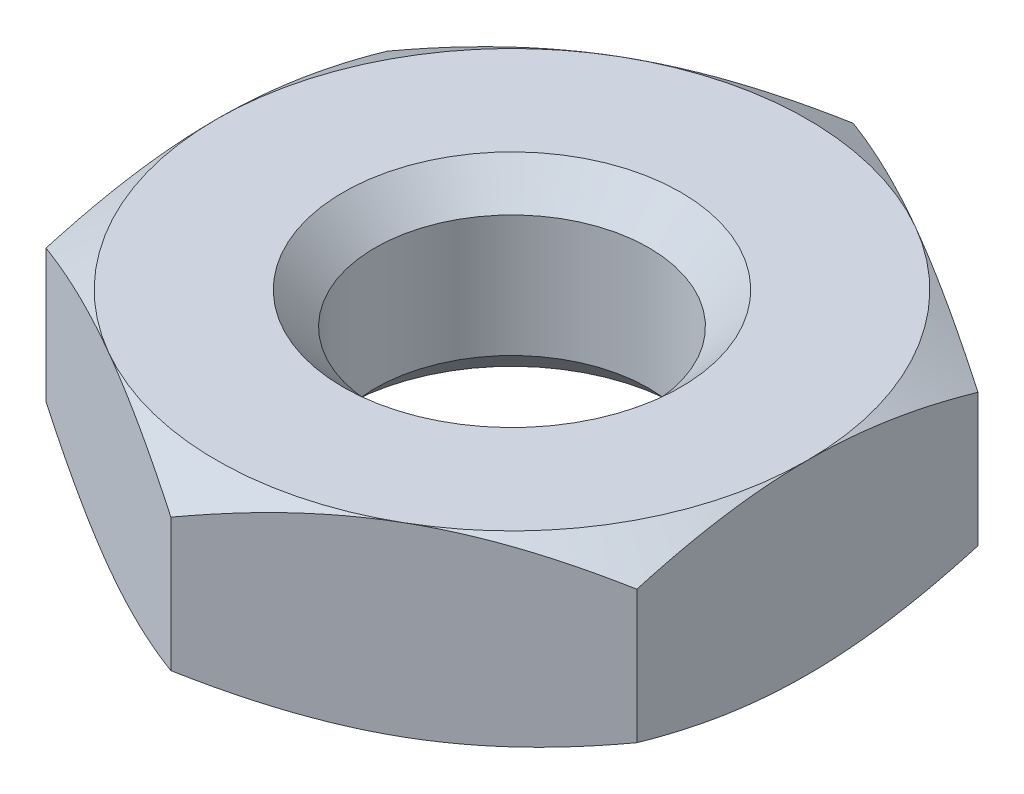
ISO-10303-21;
HEADER;
FILE_DESCRIPTION(('STEP AP214'),'2;1');
FILE_NAME('part.step','',(''),(''),'','','');
FILE_SCHEMA(('AUTOMOTIVE_DESIGN { 1 0 10303 214 1 1 1 1 }'));
ENDSEC;
DATA;
#1=APPLICATION_CONTEXT('core data for automotive mechanical design processes');
#2=APPLICATION_PROTOCOL_DEFINITION('international standard','automotive_design',2000,#1);
#3=PRODUCT_CONTEXT('',#1,'mechanical');
#4=PRODUCT('Part','Part','',(#3));
#5=PRODUCT_RELATED_PRODUCT_CATEGORY('part','',(#4));
#6=PRODUCT_DEFINITION_FORMATION('','',#4);
#7=PRODUCT_DEFINITION_CONTEXT('part definition',#1,'design');
#8=PRODUCT_DEFINITION('design','',#6,#7);
#9=PRODUCT_DEFINITION_SHAPE('','',#8);
#10=(LENGTH_UNIT() NAMED_UNIT(*) SI_UNIT(.MILLI.,.METRE.));
#11=(NAMED_UNIT(*) PLANE_ANGLE_UNIT() SI_UNIT($,.RADIAN.));
#12=(NAMED_UNIT(*) SI_UNIT($,.STERADIAN.) SOLID_ANGLE_UNIT());
#13=UNCERTAINTY_MEASURE_WITH_UNIT(LENGTH_MEASURE(1.E-05),#10,'distance_accuracy_value','');
#14=(GEOMETRIC_REPRESENTATION_CONTEXT(3) GLOBAL_UNCERTAINTY_ASSIGNED_CONTEXT((#13)) GLOBAL_UNIT_ASSIGNED_CONTEXT((#10,
#11,#12)) REPRESENTATION_CONTEXT('',''));
#15=CARTESIAN_POINT('',(0.,0.,0.));
#16=DIRECTION('',(0.,0.,1.));
#17=DIRECTION('',(1.,0.,0.));
#18=AXIS2_PLACEMENT_3D('',#15,#16,#17);
#19=CARTESIAN_POINT('',(0.,2.2,-4.04145188432738));
#20=DIRECTION('',(0.5,0.,0.866025403784439));
#21=DIRECTION('',(0.,-1.,0.));
#22=AXIS2_PLACEMENT_3D('',#19,#20,#21);
#23=PLANE('',#22);
#24=DIRECTION('',(0.,-1.,0.));
#25=VECTOR('',#24,1.);
#26=CARTESIAN_POINT('',(0.,2.2,-4.04145188432738));
#27=LINE('',#26,#25);
#28=CARTESIAN_POINT('',(0.,1.88739260883036,-4.04145188432738));
#29=VERTEX_POINT('',#28);
#30=CARTESIAN_POINT('',(0.,0.312607391169647,-4.04145188432738));
#31=VERTEX_POINT('',#30);
#32=EDGE_CURVE('E602',#29,#31,#27,.T.);
#33=ORIENTED_EDGE('',*,*,#32,.T.);
#34=CARTESIAN_POINT('',(1.22834702560197E-13,0.312607391168655,-4.04145188432745));
#35=CARTESIAN_POINT('',(-0.937822173505779,0.,-3.50000000000182));
#36=CARTESIAN_POINT('',(-1.75,0.,-3.03108891324553));
#37=B_SPLINE_CURVE_WITH_KNOTS('',2,(#34,#35,#36),.UNSPECIFIED.,.F.,.F.,(3,3),(0.,1.),.UNSPECIFIED.);
#38=CARTESIAN_POINT('',(-1.75,0.,-3.03108891324554));
#39=VERTEX_POINT('',#38);
#40=EDGE_CURVE('E11',#31,#39,#37,.T.);
#41=ORIENTED_EDGE('',*,*,#40,.T.);
#42=CARTESIAN_POINT('',(-1.75,0.,-3.03108891324553));
#43=CARTESIAN_POINT('',(-2.18326695106445,0.,-2.78094212241751));
#44=CARTESIAN_POINT('',(-2.6350882433519,0.0843875357508751,-2.52008297768974));
#45=CARTESIAN_POINT('',(-3.04504654739941,0.16095624030225,-2.28339344049139));
#46=CARTESIAN_POINT('',(-3.50000000000007,0.312607391169145,-2.02072594216365));
#47=B_SPLINE_CURVE_WITH_KNOTS('',2,(#42,#43,#44,#45,#46),.UNSPECIFIED.,.F.,.F.,(3,2,3),(0.,0.5,
1.),.UNSPECIFIED.);
#48=CARTESIAN_POINT('',(-3.5,0.312607391169648,-2.02072594216369));
#49=VERTEX_POINT('',#48);
#50=EDGE_CURVE('E29',#39,#49,#47,.T.);
#51=ORIENTED_EDGE('',*,*,#50,.T.);
#52=DIRECTION('',(0.,-1.,0.));
#53=VECTOR('',#52,1.);
#54=CARTESIAN_POINT('',(-3.5,2.2,-2.02072594216369));
#55=LINE('',#54,#53);
#56=CARTESIAN_POINT('',(-3.5,1.88739260883036,-2.02072594216369));
#57=VERTEX_POINT('',#56);
#58=EDGE_CURVE('E420',#57,#49,#55,.T.);
#59=ORIENTED_EDGE('',*,*,#58,.F.);
#60=CARTESIAN_POINT('',(-3.50000000000012,1.88739260883135,-2.02072594216362));
#61=CARTESIAN_POINT('',(-2.56217782649422,2.2,-2.56217782648925));
#62=CARTESIAN_POINT('',(-1.75,2.2,-3.03108891324553));
#63=B_SPLINE_CURVE_WITH_KNOTS('',2,(#60,#61,#62),.UNSPECIFIED.,.F.,.F.,(3,3),(0.,1.),.UNSPECIFIED.);
#64=CARTESIAN_POINT('',(-1.75,2.2,-3.03108891324554));
#65=VERTEX_POINT('',#64);
#66=EDGE_CURVE('E467',#57,#65,#63,.T.);
#67=ORIENTED_EDGE('',*,*,#66,.T.);
#68=CARTESIAN_POINT('',(-1.75,2.2,-3.03108891324553));
#69=CARTESIAN_POINT('',(-1.31673304893373,2.2,-3.28123570407461));
#70=CARTESIAN_POINT('',(-0.864911756648105,2.11561246424913,-3.54209484880132));
#71=CARTESIAN_POINT('',(-0.454953452598556,2.03904375969707,-3.77878438600085));
#72=CARTESIAN_POINT('',(0.,1.88739260883086,-4.04145188432742));
#73=B_SPLINE_CURVE_WITH_KNOTS('',2,(#68,#69,#70,#71,#72),.UNSPECIFIED.,.F.,.F.,(3,2,3),(0.,0.5,
1.),.UNSPECIFIED.);
#74=EDGE_CURVE('E124',#65,#29,#73,.T.);
#75=ORIENTED_EDGE('',*,*,#74,.T.);
#76=EDGE_LOOP('',(#33,#41,#51,#59,#67,#75));
#77=FACE_BOUND('',#76,.T.);
#78=ADVANCED_FACE('F16',(#77),#23,.F.);
#79=CARTESIAN_POINT('',(0.,0.788648588267139,0.));
#80=DIRECTION('',(0.,1.,0.));
#81=DIRECTION('',(0.,0.,1.));
#82=AXIS2_PLACEMENT_3D('',#79,#80,#81);
#83=CONICAL_SURFACE('',#82,4.8659794242,1.0471975512);
#84=CARTESIAN_POINT('',(0.,0.,0.));
#85=DIRECTION('',(0.,-1.,0.));
#86=DIRECTION('',(0.,0.,1.));
#87=AXIS2_PLACEMENT_3D('',#84,#85,#86);
#88=CIRCLE('',#87,3.5);
#89=CARTESIAN_POINT('',(1.75,0.,-3.03108891324554));
#90=VERTEX_POINT('',#89);
#91=CARTESIAN_POINT('',(3.5,0.,0.));
#92=VERTEX_POINT('',#91);
#93=EDGE_CURVE('E168',#90,#92,#88,.T.);
#94=ORIENTED_EDGE('',*,*,#93,.F.);
#95=CARTESIAN_POINT('',(3.50000000000012,0.312607391168655,-2.02072594216362));
#96=CARTESIAN_POINT('',(2.56217782649423,0.,-2.56217782648925));
#97=CARTESIAN_POINT('',(1.75,0.,-3.03108891324554));
#98=B_SPLINE_CURVE_WITH_KNOTS('',2,(#95,#96,#97),.UNSPECIFIED.,.F.,.F.,(3,3),(0.,1.),.UNSPECIFIED.);
#99=CARTESIAN_POINT('',(3.5,0.312607391169648,-2.02072594216369));
#100=VERTEX_POINT('',#99);
#101=EDGE_CURVE('E639',#100,#90,#98,.T.);
#102=ORIENTED_EDGE('',*,*,#101,.F.);
#103=CARTESIAN_POINT('',(3.5,0.,0.));
#104=CARTESIAN_POINT('',(3.5,0.,-0.498474251196286));
#105=CARTESIAN_POINT('',(3.5,0.0837611927453101,-1.01813471750671));
#106=CARTESIAN_POINT('',(3.5,0.160347693152985,-1.49328287634384));
#107=CARTESIAN_POINT('',(3.5,0.31260739116964,-2.02072594216369));
#108=B_SPLINE_CURVE_WITH_KNOTS('',2,(#103,#104,#105,#106,#107),.UNSPECIFIED.,.F.,.F.,(3,2,3),
(0.,0.5,1.),.UNSPECIFIED.);
#109=EDGE_CURVE('E968',#92,#100,#108,.T.);
#110=ORIENTED_EDGE('',*,*,#109,.F.);
#111=EDGE_LOOP('',(#94,#102,#110));
#112=FACE_BOUND('',#111,.T.);
#113=ADVANCED_FACE('F617',(#112),#83,.T.);
#114=CARTESIAN_POINT('',(0.,0.788648588267139,0.));
#115=DIRECTION('',(0.,1.,0.));
#116=DIRECTION('',(0.,0.,1.));
#117=AXIS2_PLACEMENT_3D('',#114,#115,#116);
#118=CONICAL_SURFACE('',#117,4.8659794242,1.0471975512);
#119=CARTESIAN_POINT('',(1.75,0.,-3.03108891324554));
#120=CARTESIAN_POINT('',(1.31673304893498,0.,-3.28123570407389));
#121=CARTESIAN_POINT('',(0.864911756648104,0.0843875357508751,-3.54209484880132));
#122=CARTESIAN_POINT('',(0.454953452599909,0.160956240302475,-3.77878438600007));
#123=CARTESIAN_POINT('',(0.,0.312607391169145,-4.04145188432742));
#124=B_SPLINE_CURVE_WITH_KNOTS('',2,(#119,#120,#121,#122,#123),.UNSPECIFIED.,.F.,.F.,(3,2,3),
(0.,0.5,1.),.UNSPECIFIED.);
#125=EDGE_CURVE('E606',#90,#31,#124,.T.);
#126=ORIENTED_EDGE('',*,*,#125,.F.);
#127=CARTESIAN_POINT('',(0.,0.,0.));
#128=DIRECTION('',(0.,-1.,0.));
#129=DIRECTION('',(0.,0.,1.));
#130=AXIS2_PLACEMENT_3D('',#127,#128,#129);
#131=CIRCLE('',#130,3.5);
#132=EDGE_CURVE('E594',#39,#90,#131,.T.);
#133=ORIENTED_EDGE('',*,*,#132,.F.);
#134=ORIENTED_EDGE('',*,*,#40,.F.);
#135=EDGE_LOOP('',(#126,#133,#134));
#136=FACE_BOUND('',#135,.T.);
#137=ADVANCED_FACE('F410',(#136),#118,.T.);
#138=CARTESIAN_POINT('',(0.,0.788648588267139,0.));
#139=DIRECTION('',(0.,1.,0.));
#140=DIRECTION('',(0.,0.,1.));
#141=AXIS2_PLACEMENT_3D('',#138,#139,#140);
#142=CONICAL_SURFACE('',#141,4.8659794242,1.0471975512);
#143=ORIENTED_EDGE('',*,*,#50,.F.);
#144=CARTESIAN_POINT('',(0.,0.,0.));
#145=DIRECTION('',(0.,-1.,0.));
#146=DIRECTION('',(0.,0.,1.));
#147=AXIS2_PLACEMENT_3D('',#144,#145,#146);
#148=CIRCLE('',#147,3.5);
#149=CARTESIAN_POINT('',(-3.5,0.,0.));
#150=VERTEX_POINT('',#149);
#151=EDGE_CURVE('E590',#150,#39,#148,.T.);
#152=ORIENTED_EDGE('',*,*,#151,.F.);
#153=CARTESIAN_POINT('',(-3.5,0.31260739116964,-2.02072594216369));
#154=CARTESIAN_POINT('',(-3.5,0.160519053630475,-1.49387648645068));
#155=CARTESIAN_POINT('',(-3.5,0.0837611927453101,-1.01813471750671));
#156=CARTESIAN_POINT('',(-3.5,0.,-0.49898661272657));
#157=CARTESIAN_POINT('',(-3.5,0.,0.));
#158=B_SPLINE_CURVE_WITH_KNOTS('',2,(#153,#154,#155,#156,#157),.UNSPECIFIED.,.F.,.F.,(3,2,3),
(0.,0.5,1.),.UNSPECIFIED.);
#159=EDGE_CURVE('E385',#49,#150,#158,.T.);
#160=ORIENTED_EDGE('',*,*,#159,.F.);
#161=EDGE_LOOP('',(#143,#152,#160));
#162=FACE_BOUND('',#161,.T.);
#163=ADVANCED_FACE('F402',(#162),#142,.T.);
#164=CARTESIAN_POINT('',(0.,0.788648588267139,0.));
#165=DIRECTION('',(0.,1.,0.));
#166=DIRECTION('',(0.,0.,1.));
#167=AXIS2_PLACEMENT_3D('',#164,#165,#166);
#168=CONICAL_SURFACE('',#167,4.8659794242,1.0471975512);
#169=CARTESIAN_POINT('',(0.,0.,0.));
#170=DIRECTION('',(0.,-1.,0.));
#171=DIRECTION('',(0.,0.,1.));
#172=AXIS2_PLACEMENT_3D('',#169,#170,#171);
#173=CIRCLE('',#172,3.5);
#174=CARTESIAN_POINT('',(-1.75,0.,3.03108891324554));
#175=VERTEX_POINT('',#174);
#176=EDGE_CURVE('E595',#175,#150,#173,.T.);
#177=ORIENTED_EDGE('',*,*,#176,.F.);
#178=CARTESIAN_POINT('',(-3.50000000000012,0.312607391168655,2.02072594216362));
#179=CARTESIAN_POINT('',(-2.56217782649423,0.,2.56217782648925));
#180=CARTESIAN_POINT('',(-1.75,0.,3.03108891324554));
#181=B_SPLINE_CURVE_WITH_KNOTS('',2,(#178,#179,#180),.UNSPECIFIED.,.F.,.F.,(3,3),(0.,1.),.UNSPECIFIED.);
#182=CARTESIAN_POINT('',(-3.5,0.312607391169648,2.02072594216369));
#183=VERTEX_POINT('',#182);
#184=EDGE_CURVE('E569',#183,#175,#181,.T.);
#185=ORIENTED_EDGE('',*,*,#184,.F.);
#186=CARTESIAN_POINT('',(-3.5,0.,0.));
#187=CARTESIAN_POINT('',(-3.5,0.,0.50199947639047));
#188=CARTESIAN_POINT('',(-3.5,0.0849764910881953,1.0256452662635));
#189=CARTESIAN_POINT('',(-3.5,0.161527003296065,1.49736812651518));
#190=CARTESIAN_POINT('',(-3.5,0.31260739116965,2.02072594216369));
#191=B_SPLINE_CURVE_WITH_KNOTS('',2,(#186,#187,#188,#189,#190),.UNSPECIFIED.,.F.,.F.,(3,2,3),
(0.,0.5,1.),.UNSPECIFIED.);
#192=EDGE_CURVE('E373',#150,#183,#191,.T.);
#193=ORIENTED_EDGE('',*,*,#192,.F.);
#194=EDGE_LOOP('',(#177,#185,#193));
#195=FACE_BOUND('',#194,.T.);
#196=ADVANCED_FACE('F214',(#195),#168,.T.);
#197=CARTESIAN_POINT('',(0.,0.788648588267139,0.));
#198=DIRECTION('',(0.,1.,0.));
#199=DIRECTION('',(0.,0.,1.));
#200=AXIS2_PLACEMENT_3D('',#197,#198,#199);
#201=CONICAL_SURFACE('',#200,4.8659794242,1.0471975512);
#202=CARTESIAN_POINT('',(0.,0.,0.));
#203=DIRECTION('',(0.,-1.,0.));
#204=DIRECTION('',(0.,0.,1.));
#205=AXIS2_PLACEMENT_3D('',#202,#203,#204);
#206=CIRCLE('',#205,3.5);
#207=CARTESIAN_POINT('',(1.75,0.,3.03108891324554));
#208=VERTEX_POINT('',#207);
#209=EDGE_CURVE('E162',#92,#208,#206,.T.);
#210=ORIENTED_EDGE('',*,*,#209,.F.);
#211=CARTESIAN_POINT('',(3.5,0.31260739116965,2.02072594216369));
#212=CARTESIAN_POINT('',(3.5,0.161698384794715,1.49796180944146));
#213=CARTESIAN_POINT('',(3.5,0.0849764910881953,1.0256452662635));
#214=CARTESIAN_POINT('',(3.5,0.,0.502511639300405));
#215=CARTESIAN_POINT('',(3.5,0.,0.));
#216=B_SPLINE_CURVE_WITH_KNOTS('',2,(#211,#212,#213,#214,#215),.UNSPECIFIED.,.F.,.F.,(3,2,3),
(0.,0.5,1.),.UNSPECIFIED.);
#217=CARTESIAN_POINT('',(3.5,0.312607391169648,2.02072594216369));
#218=VERTEX_POINT('',#217);
#219=EDGE_CURVE('E178',#218,#92,#216,.T.);
#220=ORIENTED_EDGE('',*,*,#219,.F.);
#221=CARTESIAN_POINT('',(1.75,0.,3.03108891324553));
#222=CARTESIAN_POINT('',(2.18326695106445,0.,2.78094212241751));
#223=CARTESIAN_POINT('',(2.6350882433519,0.0843875357508742,2.52008297768974));
#224=CARTESIAN_POINT('',(3.04504654739941,0.160956240302249,2.28339344049139));
#225=CARTESIAN_POINT('',(3.50000000000007,0.312607391169139,2.02072594216365));
#226=B_SPLINE_CURVE_WITH_KNOTS('',2,(#221,#222,#223,#224,#225),.UNSPECIFIED.,.F.,.F.,(3,2,3),
(0.,0.5,1.),.UNSPECIFIED.);
#227=EDGE_CURVE('E174',#208,#218,#226,.T.);
#228=ORIENTED_EDGE('',*,*,#227,.F.);
#229=EDGE_LOOP('',(#210,#220,#228));
#230=FACE_BOUND('',#229,.T.);
#231=ADVANCED_FACE('F176',(#230),#201,.T.);
#232=CARTESIAN_POINT('',(0.,2.2,0.));
#233=DIRECTION('',(0.,-1.,0.));
#234=DIRECTION('',(0.,0.,-1.));
#235=AXIS2_PLACEMENT_3D('',#232,#233,#234);
#236=CONICAL_SURFACE('',#235,3.5,1.0471975512);
#237=CARTESIAN_POINT('',(-1.26201132877313E-13,1.88739260883135,-4.04145188432745));
#238=CARTESIAN_POINT('',(0.937822173505772,2.2,-3.50000000000182));
#239=CARTESIAN_POINT('',(1.75,2.2,-3.03108891324554));
#240=B_SPLINE_CURVE_WITH_KNOTS('',2,(#237,#238,#239),.UNSPECIFIED.,.F.,.F.,(3,3),(0.,1.),.UNSPECIFIED.);
#241=CARTESIAN_POINT('',(1.75,2.2,-3.03108891324554));
#242=VERTEX_POINT('',#241);
#243=EDGE_CURVE('E605',#29,#242,#240,.T.);
#244=ORIENTED_EDGE('',*,*,#243,.F.);
#245=ORIENTED_EDGE('',*,*,#74,.F.);
#246=CARTESIAN_POINT('',(0.,2.2,0.));
#247=DIRECTION('',(0.,-1.,0.));
#248=DIRECTION('',(0.,0.,1.));
#249=AXIS2_PLACEMENT_3D('',#246,#247,#248);
#250=CIRCLE('',#249,3.5);
#251=EDGE_CURVE('E444',#65,#242,#250,.T.);
#252=ORIENTED_EDGE('',*,*,#251,.T.);
#253=EDGE_LOOP('',(#244,#245,#252));
#254=FACE_BOUND('',#253,.T.);
#255=ADVANCED_FACE('F249',(#254),#236,.T.);
#256=CARTESIAN_POINT('',(0.,2.2,0.));
#257=DIRECTION('',(0.,-1.,0.));
#258=DIRECTION('',(0.,0.,-1.));
#259=AXIS2_PLACEMENT_3D('',#256,#257,#258);
#260=CONICAL_SURFACE('',#259,3.5,1.0471975512);
#261=CARTESIAN_POINT('',(0.,2.2,0.));
#262=DIRECTION('',(0.,-1.,0.));
#263=DIRECTION('',(0.,0.,1.));
#264=AXIS2_PLACEMENT_3D('',#261,#262,#263);
#265=CIRCLE('',#264,3.5);
#266=CARTESIAN_POINT('',(1.75,2.2,3.03108891324554));
#267=VERTEX_POINT('',#266);
#268=CARTESIAN_POINT('',(-1.75,2.2,3.03108891324554));
#269=VERTEX_POINT('',#268);
#270=EDGE_CURVE('E510',#267,#269,#265,.T.);
#271=ORIENTED_EDGE('',*,*,#270,.T.);
#272=CARTESIAN_POINT('',(1.26201132877313E-13,1.88739260883135,4.04145188432745));
#273=CARTESIAN_POINT('',(-0.937822173505772,2.2,3.50000000000182));
#274=CARTESIAN_POINT('',(-1.75,2.2,3.03108891324554));
#275=B_SPLINE_CURVE_WITH_KNOTS('',2,(#272,#273,#274),.UNSPECIFIED.,.F.,.F.,(3,3),(0.,1.),.UNSPECIFIED.);
#276=CARTESIAN_POINT('',(0.,1.88739260883036,4.04145188432738));
#277=VERTEX_POINT('',#276);
#278=EDGE_CURVE('E552',#277,#269,#275,.T.);
#279=ORIENTED_EDGE('',*,*,#278,.F.);
#280=CARTESIAN_POINT('',(1.75,2.2,3.03108891324553));
#281=CARTESIAN_POINT('',(1.31673304893373,2.2,3.28123570407461));
#282=CARTESIAN_POINT('',(0.864911756648105,2.11561246424913,3.54209484880132));
#283=CARTESIAN_POINT('',(0.454953452598556,2.03904375969707,3.77878438600085));
#284=CARTESIAN_POINT('',(0.,1.88739260883086,4.04145188432742));
#285=B_SPLINE_CURVE_WITH_KNOTS('',2,(#280,#281,#282,#283,#284),.UNSPECIFIED.,.F.,.F.,(3,2,3),
(0.,0.5,1.),.UNSPECIFIED.);
#286=EDGE_CURVE('E969',#267,#277,#285,.T.);
#287=ORIENTED_EDGE('',*,*,#286,.F.);
#288=EDGE_LOOP('',(#271,#279,#287));
#289=FACE_BOUND('',#288,.T.);
#290=ADVANCED_FACE('F238',(#289),#260,.T.);
#291=CARTESIAN_POINT('',(0.,2.2,0.));
#292=DIRECTION('',(0.,-1.,0.));
#293=DIRECTION('',(0.,0.,-1.));
#294=AXIS2_PLACEMENT_3D('',#291,#292,#293);
#295=CONICAL_SURFACE('',#294,3.5,1.0471975512);
#296=CARTESIAN_POINT('',(1.75,2.2,-3.03108891324554));
#297=CARTESIAN_POINT('',(2.18326695106652,2.2,-2.78094212241631));
#298=CARTESIAN_POINT('',(2.6350882433519,2.11561246424912,-2.52008297768974));
#299=CARTESIAN_POINT('',(3.04504654740179,2.03904375969695,-2.28339344049002));
#300=CARTESIAN_POINT('',(3.50000000000007,1.88739260883086,-2.02072594216365));
#301=B_SPLINE_CURVE_WITH_KNOTS('',2,(#296,#297,#298,#299,#300),.UNSPECIFIED.,.F.,.F.,(3,2,3),
(0.,0.5,1.),.UNSPECIFIED.);
#302=CARTESIAN_POINT('',(3.5,1.88739260883036,-2.02072594216369));
#303=VERTEX_POINT('',#302);
#304=EDGE_CURVE('E428',#242,#303,#301,.T.);
#305=ORIENTED_EDGE('',*,*,#304,.F.);
#306=CARTESIAN_POINT('',(0.,2.2,0.));
#307=DIRECTION('',(0.,-1.,0.));
#308=DIRECTION('',(0.,0.,1.));
#309=AXIS2_PLACEMENT_3D('',#306,#307,#308);
#310=CIRCLE('',#309,3.5);
#311=CARTESIAN_POINT('',(3.5,2.2,0.));
#312=VERTEX_POINT('',#311);
#313=EDGE_CURVE('E453',#242,#312,#310,.T.);
#314=ORIENTED_EDGE('',*,*,#313,.T.);
#315=CARTESIAN_POINT('',(3.5,1.88739260883037,-2.02072594216369));
#316=CARTESIAN_POINT('',(3.5,2.0394809463691,-1.49387648645213));
#317=CARTESIAN_POINT('',(3.5,2.11623880725469,-1.0181347175067));
#318=CARTESIAN_POINT('',(3.5,2.2,-0.49898661272787));
#319=CARTESIAN_POINT('',(3.5,2.2,0.));
#320=B_SPLINE_CURVE_WITH_KNOTS('',2,(#315,#316,#317,#318,#319),.UNSPECIFIED.,.F.,.F.,(3,2,3),
(0.,0.5,1.),.UNSPECIFIED.);
#321=EDGE_CURVE('E962',#303,#312,#320,.T.);
#322=ORIENTED_EDGE('',*,*,#321,.F.);
#323=EDGE_LOOP('',(#305,#314,#322));
#324=FACE_BOUND('',#323,.T.);
#325=ADVANCED_FACE('F248',(#324),#295,.T.);
#326=CARTESIAN_POINT('',(0.,2.2,0.));
#327=DIRECTION('',(0.,-1.,0.));
#328=DIRECTION('',(0.,0.,-1.));
#329=AXIS2_PLACEMENT_3D('',#326,#327,#328);
#330=CONICAL_SURFACE('',#329,3.5,1.0471975512);
#331=CARTESIAN_POINT('',(0.,2.2,0.));
#332=DIRECTION('',(0.,-1.,0.));
#333=DIRECTION('',(0.,0.,1.));
#334=AXIS2_PLACEMENT_3D('',#331,#332,#333);
#335=CIRCLE('',#334,3.5);
#336=CARTESIAN_POINT('',(-3.5,2.2,0.));
#337=VERTEX_POINT('',#336);
#338=EDGE_CURVE('E456',#337,#65,#335,.T.);
#339=ORIENTED_EDGE('',*,*,#338,.T.);
#340=ORIENTED_EDGE('',*,*,#66,.F.);
#341=CARTESIAN_POINT('',(-3.5,2.2,0.));
#342=CARTESIAN_POINT('',(-3.5,2.2,-0.49847425119368));
#343=CARTESIAN_POINT('',(-3.5,2.11623880725469,-1.0181347175067));
#344=CARTESIAN_POINT('',(-3.5,2.0396523068479,-1.49328287634075));
#345=CARTESIAN_POINT('',(-3.5,1.88739260883037,-2.02072594216369));
#346=B_SPLINE_CURVE_WITH_KNOTS('',2,(#341,#342,#343,#344,#345),.UNSPECIFIED.,.F.,.F.,(3,2,3),
(0.,0.5,1.),.UNSPECIFIED.);
#347=EDGE_CURVE('E538',#337,#57,#346,.T.);
#348=ORIENTED_EDGE('',*,*,#347,.F.);
#349=EDGE_LOOP('',(#339,#340,#348));
#350=FACE_BOUND('',#349,.T.);
#351=ADVANCED_FACE('F18',(#350),#330,.T.);
#352=CARTESIAN_POINT('',(0.,0.788648588267139,0.));
#353=DIRECTION('',(0.,1.,0.));
#354=DIRECTION('',(0.,0.,1.));
#355=AXIS2_PLACEMENT_3D('',#352,#353,#354);
#356=CONICAL_SURFACE('',#355,4.8659794242,1.0471975512);
#357=CARTESIAN_POINT('',(0.,0.,0.));
#358=DIRECTION('',(0.,-1.,0.));
#359=DIRECTION('',(0.,0.,1.));
#360=AXIS2_PLACEMENT_3D('',#357,#358,#359);
#361=CIRCLE('',#360,3.5);
#362=EDGE_CURVE('E147',#208,#175,#361,.T.);
#363=ORIENTED_EDGE('',*,*,#362,.F.);
#364=CARTESIAN_POINT('',(-1.22862151359753E-13,0.312607391168654,4.04145188432745));
#365=CARTESIAN_POINT('',(0.937822173505779,0.,3.50000000000182));
#366=CARTESIAN_POINT('',(1.75,0.,3.03108891324553));
#367=B_SPLINE_CURVE_WITH_KNOTS('',2,(#364,#365,#366),.UNSPECIFIED.,.F.,.F.,(3,3),(0.,1.),.UNSPECIFIED.);
#368=CARTESIAN_POINT('',(0.,0.312607391169648,4.04145188432738));
#369=VERTEX_POINT('',#368);
#370=EDGE_CURVE('E151',#369,#208,#367,.T.);
#371=ORIENTED_EDGE('',*,*,#370,.F.);
#372=CARTESIAN_POINT('',(-1.75,0.,3.03108891324554));
#373=CARTESIAN_POINT('',(-1.31673304893498,0.,3.28123570407389));
#374=CARTESIAN_POINT('',(-0.864911756648104,0.0843875357508751,3.54209484880132));
#375=CARTESIAN_POINT('',(-0.454953452599909,0.160956240302475,3.77878438600007));
#376=CARTESIAN_POINT('',(0.,0.312607391169145,4.04145188432742));
#377=B_SPLINE_CURVE_WITH_KNOTS('',2,(#372,#373,#374,#375,#376),.UNSPECIFIED.,.F.,.F.,(3,2,3),
(0.,0.5,1.),.UNSPECIFIED.);
#378=EDGE_CURVE('E154',#175,#369,#377,.T.);
#379=ORIENTED_EDGE('',*,*,#378,.F.);
#380=EDGE_LOOP('',(#363,#371,#379));
#381=FACE_BOUND('',#380,.T.);
#382=ADVANCED_FACE('F149',(#381),#356,.T.);
#383=CARTESIAN_POINT('',(0.,2.2,0.));
#384=DIRECTION('',(0.,-1.,0.));
#385=DIRECTION('',(0.,0.,-1.));
#386=AXIS2_PLACEMENT_3D('',#383,#384,#385);
#387=CONICAL_SURFACE('',#386,3.5,1.0471975512);
#388=CARTESIAN_POINT('',(0.,2.2,0.));
#389=DIRECTION('',(0.,-1.,0.));
#390=DIRECTION('',(0.,0.,1.));
#391=AXIS2_PLACEMENT_3D('',#388,#389,#390);
#392=CIRCLE('',#391,3.5);
#393=EDGE_CURVE('E460',#269,#337,#392,.T.);
#394=ORIENTED_EDGE('',*,*,#393,.T.);
#395=CARTESIAN_POINT('',(-3.5,1.88739260883036,2.02072594216369));
#396=CARTESIAN_POINT('',(-3.5,2.03830161520527,1.49796180944151));
#397=CARTESIAN_POINT('',(-3.5,2.11502350891181,1.0256452662635));
#398=CARTESIAN_POINT('',(-3.5,2.2,0.502511639300541));
#399=CARTESIAN_POINT('',(-3.5,2.2,0.));
#400=B_SPLINE_CURVE_WITH_KNOTS('',2,(#395,#396,#397,#398,#399),.UNSPECIFIED.,.F.,.F.,(3,2,3),
(0.,0.5,1.),.UNSPECIFIED.);
#401=CARTESIAN_POINT('',(-3.5,1.88739260883036,2.02072594216369));
#402=VERTEX_POINT('',#401);
#403=EDGE_CURVE('E532',#402,#337,#400,.T.);
#404=ORIENTED_EDGE('',*,*,#403,.F.);
#405=CARTESIAN_POINT('',(-1.75,2.2,3.03108891324554));
#406=CARTESIAN_POINT('',(-2.18326695106652,2.2,2.78094212241631));
#407=CARTESIAN_POINT('',(-2.6350882433519,2.11561246424912,2.52008297768974));
#408=CARTESIAN_POINT('',(-3.04504654740179,2.03904375969695,2.28339344049002));
#409=CARTESIAN_POINT('',(-3.50000000000007,1.88739260883086,2.02072594216365));
#410=B_SPLINE_CURVE_WITH_KNOTS('',2,(#405,#406,#407,#408,#409),.UNSPECIFIED.,.F.,.F.,(3,2,3),
(0.,0.5,1.),.UNSPECIFIED.);
#411=EDGE_CURVE('E461',#269,#402,#410,.T.);
#412=ORIENTED_EDGE('',*,*,#411,.F.);
#413=EDGE_LOOP('',(#394,#404,#412));
#414=FACE_BOUND('',#413,.T.);
#415=ADVANCED_FACE('F296',(#414),#387,.T.);
#416=CARTESIAN_POINT('',(0.,0.379,0.));
#417=DIRECTION('',(0.,-1.,0.));
#418=DIRECTION('',(0.,0.,-1.));
#419=AXIS2_PLACEMENT_3D('',#416,#417,#418);
#420=CONICAL_SURFACE('',#419,1.621,0.7853981634);
#421=CARTESIAN_POINT('',(0.,0.379,0.));
#422=DIRECTION('',(0.,-1.,0.));
#423=DIRECTION('',(0.,0.,-1.));
#424=AXIS2_PLACEMENT_3D('',#421,#422,#423);
#425=CIRCLE('',#424,1.621);
#426=CARTESIAN_POINT('',(0.,0.379,-1.621));
#427=VERTEX_POINT('',#426);
#428=EDGE_CURVE('E39',#427,#427,#425,.T.);
#429=ORIENTED_EDGE('',*,*,#428,.F.);
#430=EDGE_LOOP('',(#429));
#431=FACE_BOUND('',#430,.T.);
#432=CARTESIAN_POINT('',(0.,0.,0.));
#433=DIRECTION('',(0.,-1.,0.));
#434=DIRECTION('',(0.,0.,-1.));
#435=AXIS2_PLACEMENT_3D('',#432,#433,#434);
#436=CIRCLE('',#435,2.);
#437=CARTESIAN_POINT('',(0.,0.,-2.));
#438=VERTEX_POINT('',#437);
#439=EDGE_CURVE('E161',#438,#438,#436,.T.);
#440=ORIENTED_EDGE('',*,*,#439,.T.);
#441=EDGE_LOOP('',(#440));
#442=FACE_BOUND('',#441,.T.);
#443=ADVANCED_FACE('F520',(#431,#442),#420,.F.);
#444=CARTESIAN_POINT('',(0.,0.,0.));
#445=DIRECTION('',(0.,1.,0.));
#446=DIRECTION('',(0.,0.,-1.));
#447=AXIS2_PLACEMENT_3D('',#444,#445,#446);
#448=CYLINDRICAL_SURFACE('',#447,1.621);
#449=ORIENTED_EDGE('',*,*,#428,.T.);
#450=EDGE_LOOP('',(#449));
#451=FACE_BOUND('',#450,.T.);
#452=CARTESIAN_POINT('',(0.,1.821,0.));
#453=DIRECTION('',(0.,-1.,0.));
#454=DIRECTION('',(0.,0.,-1.));
#455=AXIS2_PLACEMENT_3D('',#452,#453,#454);
#456=CIRCLE('',#455,1.621);
#457=CARTESIAN_POINT('',(0.,1.821,-1.621));
#458=VERTEX_POINT('',#457);
#459=EDGE_CURVE('E49',#458,#458,#456,.T.);
#460=ORIENTED_EDGE('',*,*,#459,.F.);
#461=EDGE_LOOP('',(#460));
#462=FACE_BOUND('',#461,.T.);
#463=ADVANCED_FACE('F411',(#451,#462),#448,.F.);
#464=CARTESIAN_POINT('',(0.,2.2,0.));
#465=DIRECTION('',(0.,1.,0.));
#466=DIRECTION('',(0.,0.,1.));
#467=AXIS2_PLACEMENT_3D('',#464,#465,#466);
#468=CONICAL_SURFACE('',#467,2.,0.7853981634);
#469=ORIENTED_EDGE('',*,*,#459,.T.);
#470=EDGE_LOOP('',(#469));
#471=FACE_BOUND('',#470,.T.);
#472=CARTESIAN_POINT('',(0.,2.2,0.));
#473=DIRECTION('',(0.,-1.,0.));
#474=DIRECTION('',(0.,0.,-1.));
#475=AXIS2_PLACEMENT_3D('',#472,#473,#474);
#476=CIRCLE('',#475,2.);
#477=CARTESIAN_POINT('',(0.,2.2,-2.));
#478=VERTEX_POINT('',#477);
#479=EDGE_CURVE('E452',#478,#478,#476,.T.);
#480=ORIENTED_EDGE('',*,*,#479,.F.);
#481=EDGE_LOOP('',(#480));
#482=FACE_BOUND('',#481,.T.);
#483=ADVANCED_FACE('F521',(#471,#482),#468,.F.);
#484=CARTESIAN_POINT('',(0.,0.,0.));
#485=DIRECTION('',(0.,1.,0.));
#486=DIRECTION('',(1.,0.,0.));
#487=AXIS2_PLACEMENT_3D('',#484,#485,#486);
#488=PLANE('',#487);
#489=ORIENTED_EDGE('',*,*,#439,.F.);
#490=EDGE_LOOP('',(#489));
#491=FACE_BOUND('',#490,.T.);
#492=ORIENTED_EDGE('',*,*,#176,.T.);
#493=ORIENTED_EDGE('',*,*,#151,.T.);
#494=ORIENTED_EDGE('',*,*,#132,.T.);
#495=ORIENTED_EDGE('',*,*,#93,.T.);
#496=ORIENTED_EDGE('',*,*,#209,.T.);
#497=ORIENTED_EDGE('',*,*,#362,.T.);
#498=EDGE_LOOP('',(#492,#493,#494,#495,#496,#497));
#499=FACE_BOUND('',#498,.T.);
#500=ADVANCED_FACE('F166',(#491,#499),#488,.F.);
#501=CARTESIAN_POINT('',(0.,2.2,0.));
#502=DIRECTION('',(0.,1.,0.));
#503=DIRECTION('',(1.,0.,0.));
#504=AXIS2_PLACEMENT_3D('',#501,#502,#503);
#505=PLANE('',#504);
#506=ORIENTED_EDGE('',*,*,#479,.T.);
#507=EDGE_LOOP('',(#506));
#508=FACE_BOUND('',#507,.T.);
#509=ORIENTED_EDGE('',*,*,#338,.F.);
#510=ORIENTED_EDGE('',*,*,#393,.F.);
#511=ORIENTED_EDGE('',*,*,#270,.F.);
#512=CARTESIAN_POINT('',(0.,2.2,0.));
#513=DIRECTION('',(0.,-1.,0.));
#514=DIRECTION('',(0.,0.,1.));
#515=AXIS2_PLACEMENT_3D('',#512,#513,#514);
#516=CIRCLE('',#515,3.5);
#517=EDGE_CURVE('E1052',#312,#267,#516,.T.);
#518=ORIENTED_EDGE('',*,*,#517,.F.);
#519=ORIENTED_EDGE('',*,*,#313,.F.);
#520=ORIENTED_EDGE('',*,*,#251,.F.);
#521=EDGE_LOOP('',(#509,#510,#511,#518,#519,#520));
#522=FACE_BOUND('',#521,.T.);
#523=ADVANCED_FACE('F212',(#508,#522),#505,.T.);
#524=CARTESIAN_POINT('',(-3.5,2.2,2.02072594216369));
#525=DIRECTION('',(0.5,0.,-0.866025403784439));
#526=DIRECTION('',(0.,-1.,0.));
#527=AXIS2_PLACEMENT_3D('',#524,#525,#526);
#528=PLANE('',#527);
#529=DIRECTION('',(0.,-1.,0.));
#530=VECTOR('',#529,1.);
#531=CARTESIAN_POINT('',(-3.5,2.2,2.02072594216369));
#532=LINE('',#531,#530);
#533=EDGE_CURVE('E539',#402,#183,#532,.T.);
#534=ORIENTED_EDGE('',*,*,#533,.T.);
#535=ORIENTED_EDGE('',*,*,#184,.T.);
#536=ORIENTED_EDGE('',*,*,#378,.T.);
#537=DIRECTION('',(0.,-1.,0.));
#538=VECTOR('',#537,1.);
#539=CARTESIAN_POINT('',(0.,2.2,4.04145188432738));
#540=LINE('',#539,#538);
#541=EDGE_CURVE('E191',#277,#369,#540,.T.);
#542=ORIENTED_EDGE('',*,*,#541,.F.);
#543=ORIENTED_EDGE('',*,*,#278,.T.);
#544=ORIENTED_EDGE('',*,*,#411,.T.);
#545=EDGE_LOOP('',(#534,#535,#536,#542,#543,#544));
#546=FACE_BOUND('',#545,.T.);
#547=ADVANCED_FACE('F252',(#546),#528,.F.);
#548=CARTESIAN_POINT('',(-3.5,2.2,-2.02072594216369));
#549=DIRECTION('',(1.,0.,0.));
#550=DIRECTION('',(0.,1.,0.));
#551=AXIS2_PLACEMENT_3D('',#548,#549,#550);
#552=PLANE('',#551);
#553=ORIENTED_EDGE('',*,*,#58,.T.);
#554=ORIENTED_EDGE('',*,*,#159,.T.);
#555=ORIENTED_EDGE('',*,*,#192,.T.);
#556=ORIENTED_EDGE('',*,*,#533,.F.);
#557=ORIENTED_EDGE('',*,*,#403,.T.);
#558=ORIENTED_EDGE('',*,*,#347,.T.);
#559=EDGE_LOOP('',(#553,#554,#555,#556,#557,#558));
#560=FACE_BOUND('',#559,.T.);
#561=ADVANCED_FACE('F337',(#560),#552,.F.);
#562=CARTESIAN_POINT('',(3.5,2.2,-2.02072594216369));
#563=DIRECTION('',(-0.5,0.,0.866025403784439));
#564=DIRECTION('',(0.,1.,0.));
#565=AXIS2_PLACEMENT_3D('',#562,#563,#564);
#566=PLANE('',#565);
#567=DIRECTION('',(0.,-1.,0.));
#568=VECTOR('',#567,1.);
#569=CARTESIAN_POINT('',(3.5,2.2,-2.02072594216369));
#570=LINE('',#569,#568);
#571=EDGE_CURVE('E965',#303,#100,#570,.T.);
#572=ORIENTED_EDGE('',*,*,#571,.T.);
#573=ORIENTED_EDGE('',*,*,#101,.T.);
#574=ORIENTED_EDGE('',*,*,#125,.T.);
#575=ORIENTED_EDGE('',*,*,#32,.F.);
#576=ORIENTED_EDGE('',*,*,#243,.T.);
#577=ORIENTED_EDGE('',*,*,#304,.T.);
#578=EDGE_LOOP('',(#572,#573,#574,#575,#576,#577));
#579=FACE_BOUND('',#578,.T.);
#580=ADVANCED_FACE('F341',(#579),#566,.F.);
#581=CARTESIAN_POINT('',(3.5,2.2,2.02072594216369));
#582=DIRECTION('',(-1.,0.,0.));
#583=DIRECTION('',(0.,0.,1.));
#584=AXIS2_PLACEMENT_3D('',#581,#582,#583);
#585=PLANE('',#584);
#586=DIRECTION('',(0.,-1.,0.));
#587=VECTOR('',#586,1.);
#588=CARTESIAN_POINT('',(3.5,2.2,2.02072594216369));
#589=LINE('',#588,#587);
#590=CARTESIAN_POINT('',(3.5,1.88739260883036,2.02072594216369));
#591=VERTEX_POINT('',#590);
#592=EDGE_CURVE('E184',#591,#218,#589,.T.);
#593=ORIENTED_EDGE('',*,*,#592,.T.);
#594=ORIENTED_EDGE('',*,*,#219,.T.);
#595=ORIENTED_EDGE('',*,*,#109,.T.);
#596=ORIENTED_EDGE('',*,*,#571,.F.);
#597=ORIENTED_EDGE('',*,*,#321,.T.);
#598=CARTESIAN_POINT('',(3.5,2.2,0.));
#599=CARTESIAN_POINT('',(3.5,2.2,0.501999476390395));
#600=CARTESIAN_POINT('',(3.5,2.11502350891181,1.0256452662635));
#601=CARTESIAN_POINT('',(3.5,2.03847299670399,1.49736812651497));
#602=CARTESIAN_POINT('',(3.5,1.88739260883036,2.02072594216369));
#603=B_SPLINE_CURVE_WITH_KNOTS('',2,(#598,#599,#600,#601,#602),.UNSPECIFIED.,.F.,.F.,(3,2,3),
(0.,0.5,1.),.UNSPECIFIED.);
#604=EDGE_CURVE('E1053',#312,#591,#603,.T.);
#605=ORIENTED_EDGE('',*,*,#604,.T.);
#606=EDGE_LOOP('',(#593,#594,#595,#596,#597,#605));
#607=FACE_BOUND('',#606,.T.);
#608=ADVANCED_FACE('F211',(#607),#585,.F.);
#609=CARTESIAN_POINT('',(0.,2.2,4.04145188432738));
#610=DIRECTION('',(-0.5,0.,-0.866025403784439));
#611=DIRECTION('',(-0.866025403784439,0.,0.5));
#612=AXIS2_PLACEMENT_3D('',#609,#610,#611);
#613=PLANE('',#612);
#614=ORIENTED_EDGE('',*,*,#541,.T.);
#615=ORIENTED_EDGE('',*,*,#370,.T.);
#616=ORIENTED_EDGE('',*,*,#227,.T.);
#617=ORIENTED_EDGE('',*,*,#592,.F.);
#618=CARTESIAN_POINT('',(3.50000000000012,1.88739260883135,2.02072594216362));
#619=CARTESIAN_POINT('',(2.56217782649422,2.2,2.56217782648925));
#620=CARTESIAN_POINT('',(1.75,2.2,3.03108891324553));
#621=B_SPLINE_CURVE_WITH_KNOTS('',2,(#618,#619,#620),.UNSPECIFIED.,.F.,.F.,(3,3),(0.,1.),.UNSPECIFIED.);
#622=EDGE_CURVE('E270',#591,#267,#621,.T.);
#623=ORIENTED_EDGE('',*,*,#622,.T.);
#624=ORIENTED_EDGE('',*,*,#286,.T.);
#625=EDGE_LOOP('',(#614,#615,#616,#617,#623,#624));
#626=FACE_BOUND('',#625,.T.);
#627=ADVANCED_FACE('F188',(#626),#613,.F.);
#628=CARTESIAN_POINT('',(0.,2.2,0.));
#629=DIRECTION('',(0.,-1.,0.));
#630=DIRECTION('',(0.,0.,-1.));
#631=AXIS2_PLACEMENT_3D('',#628,#629,#630);
#632=CONICAL_SURFACE('',#631,3.5,1.0471975512);
#633=ORIENTED_EDGE('',*,*,#604,.F.);
#634=ORIENTED_EDGE('',*,*,#517,.T.);
#635=ORIENTED_EDGE('',*,*,#622,.F.);
#636=EDGE_LOOP('',(#633,#634,#635));
#637=FACE_BOUND('',#636,.T.);
#638=ADVANCED_FACE('F210',(#637),#632,.T.);
#639=CLOSED_SHELL('',(#78,#113,#137,#163,#196,#231,#255,#290,#325,#351,#382,#415,#443,#463,#483,
#500,#523,#547,#561,#580,#608,#627,#638));
#640=MANIFOLD_SOLID_BREP('B1',#639);
#641=ADVANCED_BREP_SHAPE_REPRESENTATION('',(#18,#640),#14);
#642=SHAPE_DEFINITION_REPRESENTATION(#9,#641);
ENDSEC;
END-ISO-10303-21;
